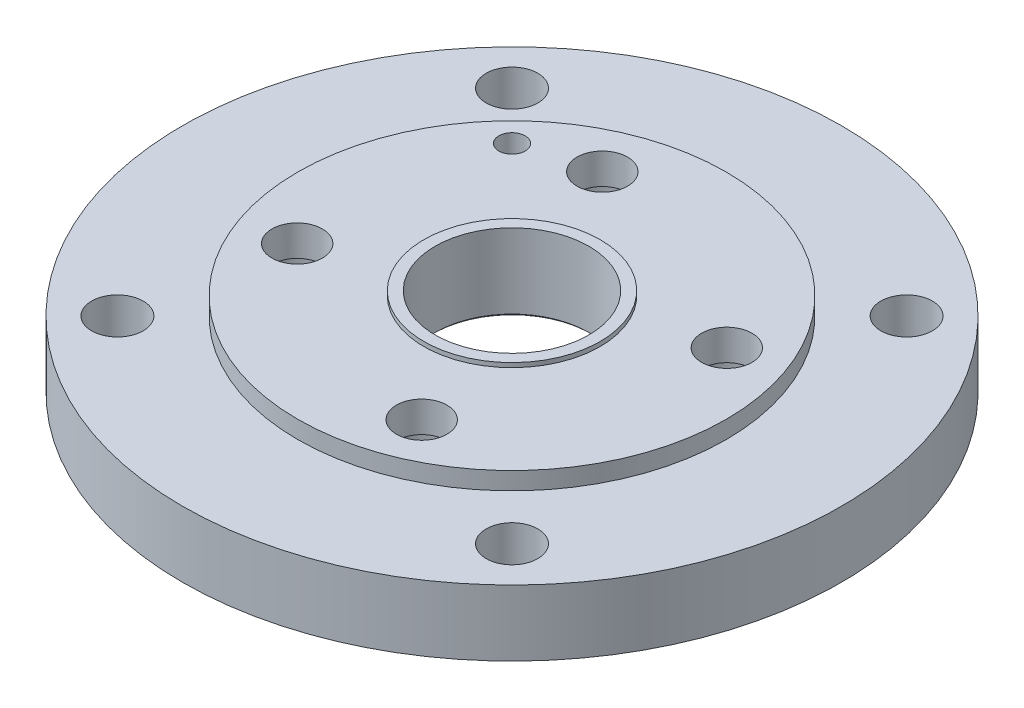
ISO-10303-21;
HEADER;
FILE_DESCRIPTION(('STEP AP214'),'2;1');
FILE_NAME('part.step','',(''),(''),'','','');
FILE_SCHEMA(('AUTOMOTIVE_DESIGN { 1 0 10303 214 1 1 1 1 }'));
ENDSEC;
DATA;
#1=APPLICATION_CONTEXT('core data for automotive mechanical design processes');
#2=APPLICATION_PROTOCOL_DEFINITION('international standard','automotive_design',2000,#1);
#3=PRODUCT_CONTEXT('',#1,'mechanical');
#4=PRODUCT('Part','Part','',(#3));
#5=PRODUCT_RELATED_PRODUCT_CATEGORY('part','',(#4));
#6=PRODUCT_DEFINITION_FORMATION('','',#4);
#7=PRODUCT_DEFINITION_CONTEXT('part definition',#1,'design');
#8=PRODUCT_DEFINITION('design','',#6,#7);
#9=PRODUCT_DEFINITION_SHAPE('','',#8);
#10=(LENGTH_UNIT() NAMED_UNIT(*) SI_UNIT(.MILLI.,.METRE.));
#11=(NAMED_UNIT(*) PLANE_ANGLE_UNIT() SI_UNIT($,.RADIAN.));
#12=(NAMED_UNIT(*) SI_UNIT($,.STERADIAN.) SOLID_ANGLE_UNIT());
#13=UNCERTAINTY_MEASURE_WITH_UNIT(LENGTH_MEASURE(1.E-05),#10,'distance_accuracy_value','');
#14=(GEOMETRIC_REPRESENTATION_CONTEXT(3) GLOBAL_UNCERTAINTY_ASSIGNED_CONTEXT((#13)) GLOBAL_UNIT_ASSIGNED_CONTEXT((#10,
#11,#12)) REPRESENTATION_CONTEXT('',''));
#15=CARTESIAN_POINT('',(0.,0.,0.));
#16=DIRECTION('',(0.,0.,1.));
#17=DIRECTION('',(1.,0.,0.));
#18=AXIS2_PLACEMENT_3D('',#15,#16,#17);
#19=CARTESIAN_POINT('',(-43.5,0.,0.));
#20=DIRECTION('',(0.,1.,0.));
#21=DIRECTION('',(0.,0.,1.));
#22=AXIS2_PLACEMENT_3D('',#19,#20,#21);
#23=PLANE('',#22);
#24=CARTESIAN_POINT('',(-28.3380590113851,0.,-69.4402938607496));
#25=DIRECTION('',(0.,1.,0.));
#26=DIRECTION('',(0.,0.,1.));
#27=AXIS2_PLACEMENT_3D('',#24,#25,#26);
#28=CIRCLE('',#27,17.5);
#29=CARTESIAN_POINT('',(-28.3380590113851,0.,-51.9402938607496));
#30=VERTEX_POINT('',#29);
#31=EDGE_CURVE('E419',#30,#30,#28,.T.);
#32=ORIENTED_EDGE('',*,*,#31,.T.);
#33=EDGE_LOOP('',(#32));
#34=FACE_BOUND('',#33,.T.);
#35=CARTESIAN_POINT('',(-69.4402938607468,0.,28.3380590113863));
#36=DIRECTION('',(0.,1.,0.));
#37=DIRECTION('',(0.,0.,1.));
#38=AXIS2_PLACEMENT_3D('',#35,#36,#37);
#39=CIRCLE('',#38,17.5);
#40=CARTESIAN_POINT('',(-69.4402938607468,0.,45.8380590113863));
#41=VERTEX_POINT('',#40);
#42=EDGE_CURVE('E420',#41,#41,#39,.T.);
#43=ORIENTED_EDGE('',*,*,#42,.T.);
#44=EDGE_LOOP('',(#43));
#45=FACE_BOUND('',#44,.T.);
#46=CARTESIAN_POINT('',(69.4402938607507,0.,-28.3380590113879));
#47=DIRECTION('',(0.,1.,0.));
#48=DIRECTION('',(0.,0.,1.));
#49=AXIS2_PLACEMENT_3D('',#46,#47,#48);
#50=CIRCLE('',#49,17.5);
#51=CARTESIAN_POINT('',(69.4402938607507,0.,-10.8380590113878));
#52=VERTEX_POINT('',#51);
#53=EDGE_CURVE('E430',#52,#52,#50,.T.);
#54=ORIENTED_EDGE('',*,*,#53,.T.);
#55=EDGE_LOOP('',(#54));
#56=FACE_BOUND('',#55,.T.);
#57=CARTESIAN_POINT('',(28.338059011389,0.,69.440293860748));
#58=DIRECTION('',(0.,1.,0.));
#59=DIRECTION('',(0.,0.,1.));
#60=AXIS2_PLACEMENT_3D('',#57,#58,#59);
#61=CIRCLE('',#60,17.5);
#62=CARTESIAN_POINT('',(28.338059011389,0.,86.940293860748));
#63=VERTEX_POINT('',#62);
#64=EDGE_CURVE('E436',#63,#63,#61,.T.);
#65=ORIENTED_EDGE('',*,*,#64,.T.);
#66=EDGE_LOOP('',(#65));
#67=FACE_BOUND('',#66,.T.);
#68=CARTESIAN_POINT('',(-89.8025612106889,0.,89.8025612106917));
#69=DIRECTION('',(0.,1.,0.));
#70=DIRECTION('',(0.,0.,1.));
#71=AXIS2_PLACEMENT_3D('',#68,#69,#70);
#72=CIRCLE('',#71,11.7500000000019);
#73=CARTESIAN_POINT('',(-89.8025612106889,0.,101.552561210694));
#74=VERTEX_POINT('',#73);
#75=EDGE_CURVE('E93',#74,#74,#72,.T.);
#76=ORIENTED_EDGE('',*,*,#75,.T.);
#77=EDGE_LOOP('',(#76));
#78=FACE_BOUND('',#77,.T.);
#79=CARTESIAN_POINT('',(89.8025612106943,0.,89.8025612106889));
#80=DIRECTION('',(0.,1.,0.));
#81=DIRECTION('',(0.,0.,1.));
#82=AXIS2_PLACEMENT_3D('',#79,#80,#81);
#83=CIRCLE('',#82,11.750000000004);
#84=CARTESIAN_POINT('',(89.8025612106943,0.,101.552561210693));
#85=VERTEX_POINT('',#84);
#86=EDGE_CURVE('E87',#85,#85,#83,.T.);
#87=ORIENTED_EDGE('',*,*,#86,.T.);
#88=EDGE_LOOP('',(#87));
#89=FACE_BOUND('',#88,.T.);
#90=CARTESIAN_POINT('',(89.8025612106914,0.,-89.8025612106942));
#91=DIRECTION('',(0.,1.,0.));
#92=DIRECTION('',(0.,0.,1.));
#93=AXIS2_PLACEMENT_3D('',#90,#91,#92);
#94=CIRCLE('',#93,11.7500000000028);
#95=CARTESIAN_POINT('',(89.8025612106914,0.,-78.0525612106914));
#96=VERTEX_POINT('',#95);
#97=EDGE_CURVE('E81',#96,#96,#94,.T.);
#98=ORIENTED_EDGE('',*,*,#97,.T.);
#99=EDGE_LOOP('',(#98));
#100=FACE_BOUND('',#99,.T.);
#101=CARTESIAN_POINT('',(-89.8025612106917,0.,-89.8025612106914));
#102=DIRECTION('',(0.,1.,0.));
#103=DIRECTION('',(0.,0.,1.));
#104=AXIS2_PLACEMENT_3D('',#101,#102,#103);
#105=CIRCLE('',#104,11.75);
#106=CARTESIAN_POINT('',(-89.8025612106917,0.,-78.0525612106914));
#107=VERTEX_POINT('',#106);
#108=EDGE_CURVE('E74',#107,#107,#105,.T.);
#109=ORIENTED_EDGE('',*,*,#108,.T.);
#110=EDGE_LOOP('',(#109));
#111=FACE_BOUND('',#110,.T.);
#112=CARTESIAN_POINT('',(-60.,0.,-60.));
#113=DIRECTION('',(0.,1.,0.));
#114=DIRECTION('',(0.,0.,1.));
#115=AXIS2_PLACEMENT_3D('',#112,#113,#114);
#116=CIRCLE('',#115,6.);
#117=CARTESIAN_POINT('',(-60.,0.,-54.));
#118=VERTEX_POINT('',#117);
#119=EDGE_CURVE('E100',#118,#118,#116,.T.);
#120=ORIENTED_EDGE('',*,*,#119,.T.);
#121=EDGE_LOOP('',(#120));
#122=FACE_BOUND('',#121,.T.);
#123=CARTESIAN_POINT('',(0.,0.,0.));
#124=DIRECTION('',(0.,1.,0.));
#125=DIRECTION('',(0.,0.,1.));
#126=AXIS2_PLACEMENT_3D('',#123,#124,#125);
#127=CIRCLE('',#126,44.4999999999999);
#128=CARTESIAN_POINT('',(0.,0.,44.4999999999999));
#129=VERTEX_POINT('',#128);
#130=EDGE_CURVE('E46',#129,#129,#127,.T.);
#131=ORIENTED_EDGE('',*,*,#130,.T.);
#132=EDGE_LOOP('',(#131));
#133=FACE_BOUND('',#132,.T.);
#134=CARTESIAN_POINT('',(0.,0.,0.));
#135=DIRECTION('',(0.,-1.,0.));
#136=DIRECTION('',(0.,0.,-1.));
#137=AXIS2_PLACEMENT_3D('',#134,#135,#136);
#138=CIRCLE('',#137,150.);
#139=CARTESIAN_POINT('',(0.,0.,-150.));
#140=VERTEX_POINT('',#139);
#141=EDGE_CURVE('E126',#140,#140,#138,.T.);
#142=ORIENTED_EDGE('',*,*,#141,.T.);
#143=EDGE_LOOP('',(#142));
#144=FACE_BOUND('',#143,.T.);
#145=ADVANCED_FACE('F33',(#34,#45,#56,#67,#78,#89,#100,#111,#122,#133,#144),#23,.F.);
#146=CARTESIAN_POINT('',(0.,0.,0.));
#147=DIRECTION('',(0.,-1.,0.));
#148=DIRECTION('',(0.,0.,-1.));
#149=AXIS2_PLACEMENT_3D('',#146,#147,#148);
#150=CYLINDRICAL_SURFACE('',#149,150.);
#151=ORIENTED_EDGE('',*,*,#141,.F.);
#152=EDGE_LOOP('',(#151));
#153=FACE_BOUND('',#152,.T.);
#154=CARTESIAN_POINT('',(0.,30.,0.));
#155=DIRECTION('',(0.,-1.,0.));
#156=DIRECTION('',(0.,0.,-1.));
#157=AXIS2_PLACEMENT_3D('',#154,#155,#156);
#158=CIRCLE('',#157,150.);
#159=CARTESIAN_POINT('',(0.,30.,-150.));
#160=VERTEX_POINT('',#159);
#161=EDGE_CURVE('E123',#160,#160,#158,.T.);
#162=ORIENTED_EDGE('',*,*,#161,.T.);
#163=EDGE_LOOP('',(#162));
#164=FACE_BOUND('',#163,.T.);
#165=ADVANCED_FACE('F158',(#153,#164),#150,.T.);
#166=CARTESIAN_POINT('',(-97.5,30.,0.));
#167=DIRECTION('',(0.,-1.,0.));
#168=DIRECTION('',(0.,0.,-1.));
#169=AXIS2_PLACEMENT_3D('',#166,#167,#168);
#170=PLANE('',#169);
#171=CARTESIAN_POINT('',(-89.8025612106889,30.,89.8025612106917));
#172=DIRECTION('',(0.,-1.,0.));
#173=DIRECTION('',(0.,0.,-1.));
#174=AXIS2_PLACEMENT_3D('',#171,#172,#173);
#175=CIRCLE('',#174,11.7500000000019);
#176=CARTESIAN_POINT('',(-89.8025612106889,30.,78.0525612106898));
#177=VERTEX_POINT('',#176);
#178=EDGE_CURVE('E96',#177,#177,#175,.T.);
#179=ORIENTED_EDGE('',*,*,#178,.T.);
#180=EDGE_LOOP('',(#179));
#181=FACE_BOUND('',#180,.T.);
#182=CARTESIAN_POINT('',(89.8025612106943,30.,89.8025612106889));
#183=DIRECTION('',(0.,-1.,0.));
#184=DIRECTION('',(0.,0.,-1.));
#185=AXIS2_PLACEMENT_3D('',#182,#183,#184);
#186=CIRCLE('',#185,11.750000000004);
#187=CARTESIAN_POINT('',(89.8025612106943,30.,78.0525612106849));
#188=VERTEX_POINT('',#187);
#189=EDGE_CURVE('E90',#188,#188,#186,.T.);
#190=ORIENTED_EDGE('',*,*,#189,.T.);
#191=EDGE_LOOP('',(#190));
#192=FACE_BOUND('',#191,.T.);
#193=CARTESIAN_POINT('',(89.8025612106914,30.,-89.8025612106942));
#194=DIRECTION('',(0.,-1.,0.));
#195=DIRECTION('',(0.,0.,-1.));
#196=AXIS2_PLACEMENT_3D('',#193,#194,#195);
#197=CIRCLE('',#196,11.7500000000028);
#198=CARTESIAN_POINT('',(89.8025612106914,30.,-101.552561210697));
#199=VERTEX_POINT('',#198);
#200=EDGE_CURVE('E84',#199,#199,#197,.T.);
#201=ORIENTED_EDGE('',*,*,#200,.T.);
#202=EDGE_LOOP('',(#201));
#203=FACE_BOUND('',#202,.T.);
#204=CARTESIAN_POINT('',(-89.8025612106917,30.,-89.8025612106914));
#205=DIRECTION('',(0.,-1.,0.));
#206=DIRECTION('',(0.,0.,-1.));
#207=AXIS2_PLACEMENT_3D('',#204,#205,#206);
#208=CIRCLE('',#207,11.75);
#209=CARTESIAN_POINT('',(-89.8025612106917,30.,-101.552561210691));
#210=VERTEX_POINT('',#209);
#211=EDGE_CURVE('E78',#210,#210,#208,.T.);
#212=ORIENTED_EDGE('',*,*,#211,.T.);
#213=EDGE_LOOP('',(#212));
#214=FACE_BOUND('',#213,.T.);
#215=ORIENTED_EDGE('',*,*,#161,.F.);
#216=EDGE_LOOP('',(#215));
#217=FACE_BOUND('',#216,.T.);
#218=CARTESIAN_POINT('',(0.,30.,0.));
#219=DIRECTION('',(0.,-1.,0.));
#220=DIRECTION('',(0.,0.,-1.));
#221=AXIS2_PLACEMENT_3D('',#218,#219,#220);
#222=CIRCLE('',#221,97.5);
#223=CARTESIAN_POINT('',(0.,30.,-97.5));
#224=VERTEX_POINT('',#223);
#225=EDGE_CURVE('E120',#224,#224,#222,.T.);
#226=ORIENTED_EDGE('',*,*,#225,.T.);
#227=EDGE_LOOP('',(#226));
#228=FACE_BOUND('',#227,.T.);
#229=ADVANCED_FACE('F164',(#181,#192,#203,#214,#217,#228),#170,.F.);
#230=CARTESIAN_POINT('',(0.,0.,0.));
#231=DIRECTION('',(0.,-1.,0.));
#232=DIRECTION('',(0.,0.,-1.));
#233=AXIS2_PLACEMENT_3D('',#230,#231,#232);
#234=CYLINDRICAL_SURFACE('',#233,97.5);
#235=ORIENTED_EDGE('',*,*,#225,.F.);
#236=EDGE_LOOP('',(#235));
#237=FACE_BOUND('',#236,.T.);
#238=CARTESIAN_POINT('',(0.,38.,0.));
#239=DIRECTION('',(0.,-1.,0.));
#240=DIRECTION('',(0.,0.,-1.));
#241=AXIS2_PLACEMENT_3D('',#238,#239,#240);
#242=CIRCLE('',#241,97.5);
#243=CARTESIAN_POINT('',(0.,38.,-97.5));
#244=VERTEX_POINT('',#243);
#245=EDGE_CURVE('E117',#244,#244,#242,.T.);
#246=ORIENTED_EDGE('',*,*,#245,.T.);
#247=EDGE_LOOP('',(#246));
#248=FACE_BOUND('',#247,.T.);
#249=ADVANCED_FACE('F172',(#237,#248),#234,.T.);
#250=CARTESIAN_POINT('',(-40.15,38.,0.));
#251=DIRECTION('',(0.,-1.,0.));
#252=DIRECTION('',(0.,0.,-1.));
#253=AXIS2_PLACEMENT_3D('',#250,#251,#252);
#254=PLANE('',#253);
#255=CARTESIAN_POINT('',(-28.3380590113851,38.,-69.4402938607496));
#256=DIRECTION('',(0.,-1.,0.));
#257=DIRECTION('',(0.,0.,-1.));
#258=AXIS2_PLACEMENT_3D('',#255,#256,#257);
#259=CIRCLE('',#258,11.5);
#260=CARTESIAN_POINT('',(-28.3380590113851,38.,-80.9402938607496));
#261=VERTEX_POINT('',#260);
#262=EDGE_CURVE('E99',#261,#261,#259,.T.);
#263=ORIENTED_EDGE('',*,*,#262,.T.);
#264=EDGE_LOOP('',(#263));
#265=FACE_BOUND('',#264,.T.);
#266=CARTESIAN_POINT('',(69.4402938607507,38.,-28.3380590113879));
#267=DIRECTION('',(0.,-1.,0.));
#268=DIRECTION('',(0.,0.,-1.));
#269=AXIS2_PLACEMENT_3D('',#266,#267,#268);
#270=CIRCLE('',#269,11.5000000000025);
#271=CARTESIAN_POINT('',(69.4402938607507,38.,-39.8380590113904));
#272=VERTEX_POINT('',#271);
#273=EDGE_CURVE('E70',#272,#272,#270,.T.);
#274=ORIENTED_EDGE('',*,*,#273,.T.);
#275=EDGE_LOOP('',(#274));
#276=FACE_BOUND('',#275,.T.);
#277=CARTESIAN_POINT('',(28.338059011389,38.,69.440293860748));
#278=DIRECTION('',(0.,-1.,0.));
#279=DIRECTION('',(0.,0.,-1.));
#280=AXIS2_PLACEMENT_3D('',#277,#278,#279);
#281=CIRCLE('',#280,11.5000000000047);
#282=CARTESIAN_POINT('',(28.338059011389,38.,57.9402938607433));
#283=VERTEX_POINT('',#282);
#284=EDGE_CURVE('E65',#283,#283,#281,.T.);
#285=ORIENTED_EDGE('',*,*,#284,.T.);
#286=EDGE_LOOP('',(#285));
#287=FACE_BOUND('',#286,.T.);
#288=CARTESIAN_POINT('',(-69.4402938607468,38.,28.3380590113863));
#289=DIRECTION('',(0.,-1.,0.));
#290=DIRECTION('',(0.,0.,-1.));
#291=AXIS2_PLACEMENT_3D('',#288,#289,#290);
#292=CIRCLE('',#291,11.5000000000027);
#293=CARTESIAN_POINT('',(-69.4402938607468,38.,16.8380590113836));
#294=VERTEX_POINT('',#293);
#295=EDGE_CURVE('E61',#294,#294,#292,.T.);
#296=ORIENTED_EDGE('',*,*,#295,.T.);
#297=EDGE_LOOP('',(#296));
#298=FACE_BOUND('',#297,.T.);
#299=CARTESIAN_POINT('',(-60.,38.,-60.));
#300=DIRECTION('',(0.,-1.,0.));
#301=DIRECTION('',(0.,0.,-1.));
#302=AXIS2_PLACEMENT_3D('',#299,#300,#301);
#303=CIRCLE('',#302,6.);
#304=CARTESIAN_POINT('',(-60.,38.,-66.));
#305=VERTEX_POINT('',#304);
#306=EDGE_CURVE('E77',#305,#305,#303,.T.);
#307=ORIENTED_EDGE('',*,*,#306,.T.);
#308=EDGE_LOOP('',(#307));
#309=FACE_BOUND('',#308,.T.);
#310=ORIENTED_EDGE('',*,*,#245,.F.);
#311=EDGE_LOOP('',(#310));
#312=FACE_BOUND('',#311,.T.);
#313=CARTESIAN_POINT('',(0.,38.,0.));
#314=DIRECTION('',(0.,-1.,0.));
#315=DIRECTION('',(0.,0.,-1.));
#316=AXIS2_PLACEMENT_3D('',#313,#314,#315);
#317=CIRCLE('',#316,40.15);
#318=CARTESIAN_POINT('',(0.,38.,-40.15));
#319=VERTEX_POINT('',#318);
#320=EDGE_CURVE('E114',#319,#319,#317,.T.);
#321=ORIENTED_EDGE('',*,*,#320,.T.);
#322=EDGE_LOOP('',(#321));
#323=FACE_BOUND('',#322,.T.);
#324=ADVANCED_FACE('F176',(#265,#276,#287,#298,#309,#312,#323),#254,.F.);
#325=CARTESIAN_POINT('',(0.,0.,0.));
#326=DIRECTION('',(0.,-1.,0.));
#327=DIRECTION('',(0.,0.,-1.));
#328=AXIS2_PLACEMENT_3D('',#325,#326,#327);
#329=CYLINDRICAL_SURFACE('',#328,40.15);
#330=ORIENTED_EDGE('',*,*,#320,.F.);
#331=EDGE_LOOP('',(#330));
#332=FACE_BOUND('',#331,.T.);
#333=CARTESIAN_POINT('',(0.,40.,0.));
#334=DIRECTION('',(0.,-1.,0.));
#335=DIRECTION('',(0.,0.,-1.));
#336=AXIS2_PLACEMENT_3D('',#333,#334,#335);
#337=CIRCLE('',#336,40.15);
#338=CARTESIAN_POINT('',(0.,40.,-40.15));
#339=VERTEX_POINT('',#338);
#340=EDGE_CURVE('E111',#339,#339,#337,.T.);
#341=ORIENTED_EDGE('',*,*,#340,.T.);
#342=EDGE_LOOP('',(#341));
#343=FACE_BOUND('',#342,.T.);
#344=ADVANCED_FACE('F180',(#332,#343),#329,.T.);
#345=CARTESIAN_POINT('',(-40.15,40.,0.));
#346=DIRECTION('',(0.,-1.,0.));
#347=DIRECTION('',(0.,0.,-1.));
#348=AXIS2_PLACEMENT_3D('',#345,#346,#347);
#349=PLANE('',#348);
#350=ORIENTED_EDGE('',*,*,#340,.F.);
#351=EDGE_LOOP('',(#350));
#352=FACE_BOUND('',#351,.T.);
#353=CARTESIAN_POINT('',(0.,40.,0.));
#354=DIRECTION('',(0.,-1.,0.));
#355=DIRECTION('',(0.,0.,-1.));
#356=AXIS2_PLACEMENT_3D('',#353,#354,#355);
#357=CIRCLE('',#356,35.);
#358=CARTESIAN_POINT('',(0.,40.,-35.));
#359=VERTEX_POINT('',#358);
#360=EDGE_CURVE('E108',#359,#359,#357,.T.);
#361=ORIENTED_EDGE('',*,*,#360,.T.);
#362=EDGE_LOOP('',(#361));
#363=FACE_BOUND('',#362,.T.);
#364=ADVANCED_FACE('F154',(#352,#363),#349,.F.);
#365=CARTESIAN_POINT('',(0.,0.,0.));
#366=DIRECTION('',(0.,-1.,0.));
#367=DIRECTION('',(0.,0.,-1.));
#368=AXIS2_PLACEMENT_3D('',#365,#366,#367);
#369=CYLINDRICAL_SURFACE('',#368,35.);
#370=CARTESIAN_POINT('',(0.,5.99999999999988,0.));
#371=DIRECTION('',(0.,1.,0.));
#372=DIRECTION('',(0.,0.,1.));
#373=AXIS2_PLACEMENT_3D('',#370,#371,#372);
#374=CIRCLE('',#373,35.);
#375=CARTESIAN_POINT('',(0.,5.99999999999988,35.));
#376=VERTEX_POINT('',#375);
#377=EDGE_CURVE('E41',#376,#376,#374,.F.);
#378=ORIENTED_EDGE('',*,*,#377,.T.);
#379=EDGE_LOOP('',(#378));
#380=FACE_BOUND('',#379,.T.);
#381=ORIENTED_EDGE('',*,*,#360,.F.);
#382=EDGE_LOOP('',(#381));
#383=FACE_BOUND('',#382,.T.);
#384=ADVANCED_FACE('F149',(#380,#383),#369,.F.);
#385=CARTESIAN_POINT('',(-35.,5.,0.));
#386=DIRECTION('',(0.,1.,0.));
#387=DIRECTION('',(0.,0.,1.));
#388=AXIS2_PLACEMENT_3D('',#385,#386,#387);
#389=PLANE('',#388);
#390=CARTESIAN_POINT('',(0.,5.,0.));
#391=DIRECTION('',(0.,1.,0.));
#392=DIRECTION('',(0.,0.,1.));
#393=AXIS2_PLACEMENT_3D('',#390,#391,#392);
#394=CIRCLE('',#393,35.9999999999999);
#395=CARTESIAN_POINT('',(0.,5.,35.9999999999999));
#396=VERTEX_POINT('',#395);
#397=EDGE_CURVE('E10',#396,#396,#394,.T.);
#398=ORIENTED_EDGE('',*,*,#397,.T.);
#399=EDGE_LOOP('',(#398));
#400=FACE_BOUND('',#399,.T.);
#401=CARTESIAN_POINT('',(0.,5.,0.));
#402=DIRECTION('',(0.,-1.,0.));
#403=DIRECTION('',(0.,0.,-1.));
#404=AXIS2_PLACEMENT_3D('',#401,#402,#403);
#405=CIRCLE('',#404,43.5);
#406=CARTESIAN_POINT('',(0.,5.,-43.5));
#407=VERTEX_POINT('',#406);
#408=EDGE_CURVE('E103',#407,#407,#405,.T.);
#409=ORIENTED_EDGE('',*,*,#408,.T.);
#410=EDGE_LOOP('',(#409));
#411=FACE_BOUND('',#410,.T.);
#412=ADVANCED_FACE('F144',(#400,#411),#389,.F.);
#413=CARTESIAN_POINT('',(0.,0.,0.));
#414=DIRECTION('',(0.,-1.,0.));
#415=DIRECTION('',(0.,0.,-1.));
#416=AXIS2_PLACEMENT_3D('',#413,#414,#415);
#417=CYLINDRICAL_SURFACE('',#416,43.5);
#418=CARTESIAN_POINT('',(0.,0.999999999999909,0.));
#419=DIRECTION('',(0.,1.,0.));
#420=DIRECTION('',(0.,0.,1.));
#421=AXIS2_PLACEMENT_3D('',#418,#419,#420);
#422=CIRCLE('',#421,43.5);
#423=CARTESIAN_POINT('',(0.,0.999999999999909,43.5));
#424=VERTEX_POINT('',#423);
#425=EDGE_CURVE('E129',#424,#424,#422,.F.);
#426=ORIENTED_EDGE('',*,*,#425,.T.);
#427=EDGE_LOOP('',(#426));
#428=FACE_BOUND('',#427,.T.);
#429=ORIENTED_EDGE('',*,*,#408,.F.);
#430=EDGE_LOOP('',(#429));
#431=FACE_BOUND('',#430,.T.);
#432=ADVANCED_FACE('F139',(#428,#431),#417,.F.);
#433=CARTESIAN_POINT('',(0.,0.999999999999909,0.));
#434=DIRECTION('',(0.,-1.,0.));
#435=DIRECTION('',(0.,0.,-1.));
#436=AXIS2_PLACEMENT_3D('',#433,#434,#435);
#437=CONICAL_SURFACE('',#436,43.5,0.785398163397455);
#438=ORIENTED_EDGE('',*,*,#130,.F.);
#439=EDGE_LOOP('',(#438));
#440=FACE_BOUND('',#439,.T.);
#441=ORIENTED_EDGE('',*,*,#425,.F.);
#442=EDGE_LOOP('',(#441));
#443=FACE_BOUND('',#442,.T.);
#444=ADVANCED_FACE('F136',(#440,#443),#437,.F.);
#445=CARTESIAN_POINT('',(0.,5.99999999999988,0.));
#446=DIRECTION('',(0.,-1.,0.));
#447=DIRECTION('',(0.,0.,-1.));
#448=AXIS2_PLACEMENT_3D('',#445,#446,#447);
#449=CONICAL_SURFACE('',#448,35.,0.785398163397441);
#450=ORIENTED_EDGE('',*,*,#397,.F.);
#451=EDGE_LOOP('',(#450));
#452=FACE_BOUND('',#451,.T.);
#453=ORIENTED_EDGE('',*,*,#377,.F.);
#454=EDGE_LOOP('',(#453));
#455=FACE_BOUND('',#454,.T.);
#456=ADVANCED_FACE('F35',(#452,#455),#449,.F.);
#457=CARTESIAN_POINT('',(-60.,40.001,-60.));
#458=DIRECTION('',(0.,-1.,0.));
#459=DIRECTION('',(0.,0.,-1.));
#460=AXIS2_PLACEMENT_3D('',#457,#458,#459);
#461=CYLINDRICAL_SURFACE('',#460,6.);
#462=ORIENTED_EDGE('',*,*,#119,.F.);
#463=EDGE_LOOP('',(#462));
#464=FACE_BOUND('',#463,.T.);
#465=ORIENTED_EDGE('',*,*,#306,.F.);
#466=EDGE_LOOP('',(#465));
#467=FACE_BOUND('',#466,.T.);
#468=ADVANCED_FACE('F225',(#464,#467),#461,.F.);
#469=CARTESIAN_POINT('',(-89.8025612106917,40.001,-89.8025612106914));
#470=DIRECTION('',(0.,-1.,0.));
#471=DIRECTION('',(0.,0.,-1.));
#472=AXIS2_PLACEMENT_3D('',#469,#470,#471);
#473=CYLINDRICAL_SURFACE('',#472,11.75);
#474=ORIENTED_EDGE('',*,*,#108,.F.);
#475=EDGE_LOOP('',(#474));
#476=FACE_BOUND('',#475,.T.);
#477=ORIENTED_EDGE('',*,*,#211,.F.);
#478=EDGE_LOOP('',(#477));
#479=FACE_BOUND('',#478,.T.);
#480=ADVANCED_FACE('F242',(#476,#479),#473,.F.);
#481=CARTESIAN_POINT('',(89.8025612106914,40.001,-89.8025612106942));
#482=DIRECTION('',(0.,-1.,0.));
#483=DIRECTION('',(0.,0.,-1.));
#484=AXIS2_PLACEMENT_3D('',#481,#482,#483);
#485=CYLINDRICAL_SURFACE('',#484,11.7500000000028);
#486=ORIENTED_EDGE('',*,*,#97,.F.);
#487=EDGE_LOOP('',(#486));
#488=FACE_BOUND('',#487,.T.);
#489=ORIENTED_EDGE('',*,*,#200,.F.);
#490=EDGE_LOOP('',(#489));
#491=FACE_BOUND('',#490,.T.);
#492=ADVANCED_FACE('F252',(#488,#491),#485,.F.);
#493=CARTESIAN_POINT('',(89.8025612106943,40.001,89.8025612106889));
#494=DIRECTION('',(0.,-1.,0.));
#495=DIRECTION('',(0.,0.,-1.));
#496=AXIS2_PLACEMENT_3D('',#493,#494,#495);
#497=CYLINDRICAL_SURFACE('',#496,11.750000000004);
#498=ORIENTED_EDGE('',*,*,#86,.F.);
#499=EDGE_LOOP('',(#498));
#500=FACE_BOUND('',#499,.T.);
#501=ORIENTED_EDGE('',*,*,#189,.F.);
#502=EDGE_LOOP('',(#501));
#503=FACE_BOUND('',#502,.T.);
#504=ADVANCED_FACE('F262',(#500,#503),#497,.F.);
#505=CARTESIAN_POINT('',(-89.8025612106889,40.001,89.8025612106917));
#506=DIRECTION('',(0.,-1.,0.));
#507=DIRECTION('',(0.,0.,-1.));
#508=AXIS2_PLACEMENT_3D('',#505,#506,#507);
#509=CYLINDRICAL_SURFACE('',#508,11.7500000000019);
#510=ORIENTED_EDGE('',*,*,#75,.F.);
#511=EDGE_LOOP('',(#510));
#512=FACE_BOUND('',#511,.T.);
#513=ORIENTED_EDGE('',*,*,#178,.F.);
#514=EDGE_LOOP('',(#513));
#515=FACE_BOUND('',#514,.T.);
#516=ADVANCED_FACE('F272',(#512,#515),#509,.F.);
#517=CARTESIAN_POINT('',(-69.4402938607468,40.001,28.3380590113863));
#518=DIRECTION('',(0.,-1.,0.));
#519=DIRECTION('',(0.,0.,-1.));
#520=AXIS2_PLACEMENT_3D('',#517,#518,#519);
#521=CYLINDRICAL_SURFACE('',#520,11.5000000000027);
#522=CARTESIAN_POINT('',(-69.4402938607468,24.,28.3380590113863));
#523=DIRECTION('',(0.,1.,0.));
#524=DIRECTION('',(0.,0.,1.));
#525=AXIS2_PLACEMENT_3D('',#522,#523,#524);
#526=CIRCLE('',#525,11.5000000000027);
#527=CARTESIAN_POINT('',(-69.4402938607468,24.,39.838059011389));
#528=VERTEX_POINT('',#527);
#529=EDGE_CURVE('E37',#528,#528,#526,.T.);
#530=ORIENTED_EDGE('',*,*,#529,.F.);
#531=EDGE_LOOP('',(#530));
#532=FACE_BOUND('',#531,.T.);
#533=ORIENTED_EDGE('',*,*,#295,.F.);
#534=EDGE_LOOP('',(#533));
#535=FACE_BOUND('',#534,.T.);
#536=ADVANCED_FACE('F282',(#532,#535),#521,.F.);
#537=CARTESIAN_POINT('',(28.338059011389,40.001,69.440293860748));
#538=DIRECTION('',(0.,-1.,0.));
#539=DIRECTION('',(0.,0.,-1.));
#540=AXIS2_PLACEMENT_3D('',#537,#538,#539);
#541=CYLINDRICAL_SURFACE('',#540,11.5000000000047);
#542=CARTESIAN_POINT('',(28.338059011389,24.,69.440293860748));
#543=DIRECTION('',(0.,1.,0.));
#544=DIRECTION('',(0.,0.,1.));
#545=AXIS2_PLACEMENT_3D('',#542,#543,#544);
#546=CIRCLE('',#545,11.5000000000047);
#547=CARTESIAN_POINT('',(28.338059011389,24.,80.9402938607527));
#548=VERTEX_POINT('',#547);
#549=EDGE_CURVE('E56',#548,#548,#546,.T.);
#550=ORIENTED_EDGE('',*,*,#549,.F.);
#551=EDGE_LOOP('',(#550));
#552=FACE_BOUND('',#551,.T.);
#553=ORIENTED_EDGE('',*,*,#284,.F.);
#554=EDGE_LOOP('',(#553));
#555=FACE_BOUND('',#554,.T.);
#556=ADVANCED_FACE('F303',(#552,#555),#541,.F.);
#557=CARTESIAN_POINT('',(69.4402938607507,40.001,-28.3380590113879));
#558=DIRECTION('',(0.,-1.,0.));
#559=DIRECTION('',(0.,0.,-1.));
#560=AXIS2_PLACEMENT_3D('',#557,#558,#559);
#561=CYLINDRICAL_SURFACE('',#560,11.5000000000025);
#562=CARTESIAN_POINT('',(69.4402938607507,24.,-28.3380590113879));
#563=DIRECTION('',(0.,1.,0.));
#564=DIRECTION('',(0.,0.,1.));
#565=AXIS2_PLACEMENT_3D('',#562,#563,#564);
#566=CIRCLE('',#565,11.5000000000025);
#567=CARTESIAN_POINT('',(69.4402938607507,24.,-16.8380590113853));
#568=VERTEX_POINT('',#567);
#569=EDGE_CURVE('E53',#568,#568,#566,.T.);
#570=ORIENTED_EDGE('',*,*,#569,.F.);
#571=EDGE_LOOP('',(#570));
#572=FACE_BOUND('',#571,.T.);
#573=ORIENTED_EDGE('',*,*,#273,.F.);
#574=EDGE_LOOP('',(#573));
#575=FACE_BOUND('',#574,.T.);
#576=ADVANCED_FACE('F313',(#572,#575),#561,.F.);
#577=CARTESIAN_POINT('',(-28.3380590113851,40.001,-69.4402938607496));
#578=DIRECTION('',(0.,-1.,0.));
#579=DIRECTION('',(0.,0.,-1.));
#580=AXIS2_PLACEMENT_3D('',#577,#578,#579);
#581=CYLINDRICAL_SURFACE('',#580,11.5);
#582=CARTESIAN_POINT('',(-28.3380590113851,24.,-69.4402938607496));
#583=DIRECTION('',(0.,1.,0.));
#584=DIRECTION('',(0.,0.,1.));
#585=AXIS2_PLACEMENT_3D('',#582,#583,#584);
#586=CIRCLE('',#585,11.5);
#587=CARTESIAN_POINT('',(-28.3380590113851,24.,-57.9402938607496));
#588=VERTEX_POINT('',#587);
#589=EDGE_CURVE('E50',#588,#588,#586,.T.);
#590=ORIENTED_EDGE('',*,*,#589,.F.);
#591=EDGE_LOOP('',(#590));
#592=FACE_BOUND('',#591,.T.);
#593=ORIENTED_EDGE('',*,*,#262,.F.);
#594=EDGE_LOOP('',(#593));
#595=FACE_BOUND('',#594,.T.);
#596=ADVANCED_FACE('F323',(#592,#595),#581,.F.);
#597=CARTESIAN_POINT('',(-28.3380590113851,24.,-69.4402938607496));
#598=DIRECTION('',(0.,-1.,0.));
#599=DIRECTION('',(0.,0.,-1.));
#600=AXIS2_PLACEMENT_3D('',#597,#598,#599);
#601=CYLINDRICAL_SURFACE('',#600,17.5);
#602=CARTESIAN_POINT('',(-28.3380590113851,24.,-69.4402938607496));
#603=DIRECTION('',(0.,1.,0.));
#604=DIRECTION('',(0.,0.,1.));
#605=AXIS2_PLACEMENT_3D('',#602,#603,#604);
#606=CIRCLE('',#605,17.5);
#607=CARTESIAN_POINT('',(-28.3380590113851,24.,-51.9402938607496));
#608=VERTEX_POINT('',#607);
#609=EDGE_CURVE('E54',#608,#608,#606,.T.);
#610=ORIENTED_EDGE('',*,*,#609,.T.);
#611=EDGE_LOOP('',(#610));
#612=FACE_BOUND('',#611,.T.);
#613=ORIENTED_EDGE('',*,*,#31,.F.);
#614=EDGE_LOOP('',(#613));
#615=FACE_BOUND('',#614,.T.);
#616=ADVANCED_FACE('F333',(#612,#615),#601,.F.);
#617=CARTESIAN_POINT('',(-28.3380590113851,24.,-69.4402938607496));
#618=DIRECTION('',(0.,1.,0.));
#619=DIRECTION('',(0.,0.,1.));
#620=AXIS2_PLACEMENT_3D('',#617,#618,#619);
#621=PLANE('',#620);
#622=ORIENTED_EDGE('',*,*,#589,.T.);
#623=EDGE_LOOP('',(#622));
#624=FACE_BOUND('',#623,.T.);
#625=ORIENTED_EDGE('',*,*,#609,.F.);
#626=EDGE_LOOP('',(#625));
#627=FACE_BOUND('',#626,.T.);
#628=ADVANCED_FACE('F343',(#624,#627),#621,.F.);
#629=CARTESIAN_POINT('',(69.4402938607507,24.,-28.3380590113879));
#630=DIRECTION('',(0.,-1.,0.));
#631=DIRECTION('',(0.,0.,-1.));
#632=AXIS2_PLACEMENT_3D('',#629,#630,#631);
#633=CYLINDRICAL_SURFACE('',#632,17.5);
#634=CARTESIAN_POINT('',(69.4402938607507,24.,-28.3380590113879));
#635=DIRECTION('',(0.,1.,0.));
#636=DIRECTION('',(0.,0.,1.));
#637=AXIS2_PLACEMENT_3D('',#634,#635,#636);
#638=CIRCLE('',#637,17.5);
#639=CARTESIAN_POINT('',(69.4402938607507,24.,-10.8380590113878));
#640=VERTEX_POINT('',#639);
#641=EDGE_CURVE('E424',#640,#640,#638,.T.);
#642=ORIENTED_EDGE('',*,*,#641,.T.);
#643=EDGE_LOOP('',(#642));
#644=FACE_BOUND('',#643,.T.);
#645=ORIENTED_EDGE('',*,*,#53,.F.);
#646=EDGE_LOOP('',(#645));
#647=FACE_BOUND('',#646,.T.);
#648=ADVANCED_FACE('F353',(#644,#647),#633,.F.);
#649=CARTESIAN_POINT('',(69.4402938607507,24.,-28.3380590113879));
#650=DIRECTION('',(0.,1.,0.));
#651=DIRECTION('',(0.,0.,1.));
#652=AXIS2_PLACEMENT_3D('',#649,#650,#651);
#653=PLANE('',#652);
#654=ORIENTED_EDGE('',*,*,#569,.T.);
#655=EDGE_LOOP('',(#654));
#656=FACE_BOUND('',#655,.T.);
#657=ORIENTED_EDGE('',*,*,#641,.F.);
#658=EDGE_LOOP('',(#657));
#659=FACE_BOUND('',#658,.T.);
#660=ADVANCED_FACE('F363',(#656,#659),#653,.F.);
#661=CARTESIAN_POINT('',(28.338059011389,24.,69.440293860748));
#662=DIRECTION('',(0.,-1.,0.));
#663=DIRECTION('',(0.,0.,-1.));
#664=AXIS2_PLACEMENT_3D('',#661,#662,#663);
#665=CYLINDRICAL_SURFACE('',#664,17.5);
#666=CARTESIAN_POINT('',(28.338059011389,24.,69.440293860748));
#667=DIRECTION('',(0.,1.,0.));
#668=DIRECTION('',(0.,0.,1.));
#669=AXIS2_PLACEMENT_3D('',#666,#667,#668);
#670=CIRCLE('',#669,17.5);
#671=CARTESIAN_POINT('',(28.338059011389,24.,86.940293860748));
#672=VERTEX_POINT('',#671);
#673=EDGE_CURVE('E433',#672,#672,#670,.T.);
#674=ORIENTED_EDGE('',*,*,#673,.T.);
#675=EDGE_LOOP('',(#674));
#676=FACE_BOUND('',#675,.T.);
#677=ORIENTED_EDGE('',*,*,#64,.F.);
#678=EDGE_LOOP('',(#677));
#679=FACE_BOUND('',#678,.T.);
#680=ADVANCED_FACE('F373',(#676,#679),#665,.F.);
#681=CARTESIAN_POINT('',(28.338059011389,24.,69.440293860748));
#682=DIRECTION('',(0.,1.,0.));
#683=DIRECTION('',(0.,0.,1.));
#684=AXIS2_PLACEMENT_3D('',#681,#682,#683);
#685=PLANE('',#684);
#686=ORIENTED_EDGE('',*,*,#549,.T.);
#687=EDGE_LOOP('',(#686));
#688=FACE_BOUND('',#687,.T.);
#689=ORIENTED_EDGE('',*,*,#673,.F.);
#690=EDGE_LOOP('',(#689));
#691=FACE_BOUND('',#690,.T.);
#692=ADVANCED_FACE('F383',(#688,#691),#685,.F.);
#693=CARTESIAN_POINT('',(-69.4402938607468,24.,28.3380590113863));
#694=DIRECTION('',(0.,-1.,0.));
#695=DIRECTION('',(0.,0.,-1.));
#696=AXIS2_PLACEMENT_3D('',#693,#694,#695);
#697=CYLINDRICAL_SURFACE('',#696,17.5);
#698=CARTESIAN_POINT('',(-69.4402938607468,24.,28.3380590113863));
#699=DIRECTION('',(0.,1.,0.));
#700=DIRECTION('',(0.,0.,1.));
#701=AXIS2_PLACEMENT_3D('',#698,#699,#700);
#702=CIRCLE('',#701,17.5);
#703=CARTESIAN_POINT('',(-69.4402938607468,24.,45.8380590113863));
#704=VERTEX_POINT('',#703);
#705=EDGE_CURVE('E418',#704,#704,#702,.T.);
#706=ORIENTED_EDGE('',*,*,#705,.T.);
#707=EDGE_LOOP('',(#706));
#708=FACE_BOUND('',#707,.T.);
#709=ORIENTED_EDGE('',*,*,#42,.F.);
#710=EDGE_LOOP('',(#709));
#711=FACE_BOUND('',#710,.T.);
#712=ADVANCED_FACE('F393',(#708,#711),#697,.F.);
#713=CARTESIAN_POINT('',(-69.4402938607468,24.,28.3380590113863));
#714=DIRECTION('',(0.,1.,0.));
#715=DIRECTION('',(0.,0.,1.));
#716=AXIS2_PLACEMENT_3D('',#713,#714,#715);
#717=PLANE('',#716);
#718=ORIENTED_EDGE('',*,*,#529,.T.);
#719=EDGE_LOOP('',(#718));
#720=FACE_BOUND('',#719,.T.);
#721=ORIENTED_EDGE('',*,*,#705,.F.);
#722=EDGE_LOOP('',(#721));
#723=FACE_BOUND('',#722,.T.);
#724=ADVANCED_FACE('F402',(#720,#723),#717,.F.);
#725=CLOSED_SHELL('',(#145,#165,#229,#249,#324,#344,#364,#384,#412,#432,#444,#456,#468,#480,
#492,#504,#516,#536,#556,#576,#596,#616,#628,#648,#660,#680,#692,#712,#724));
#726=MANIFOLD_SOLID_BREP('B2',#725);
#727=ADVANCED_BREP_SHAPE_REPRESENTATION('',(#18,#726),#14);
#728=SHAPE_DEFINITION_REPRESENTATION(#9,#727);
ENDSEC;
END-ISO-10303-21;
